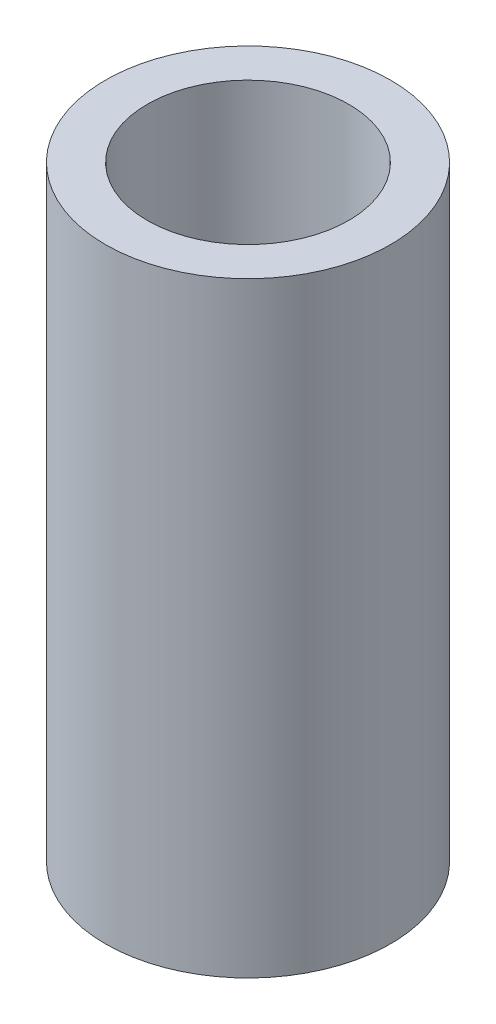
ISO-10303-21;
HEADER;
FILE_DESCRIPTION(('STEP AP214'),'2;1');
FILE_NAME('part.step','',(''),(''),'','','');
FILE_SCHEMA(('AUTOMOTIVE_DESIGN { 1 0 10303 214 1 1 1 1 }'));
ENDSEC;
DATA;
#1=APPLICATION_CONTEXT('core data for automotive mechanical design processes');
#2=APPLICATION_PROTOCOL_DEFINITION('international standard','automotive_design',2000,#1);
#3=PRODUCT_CONTEXT('',#1,'mechanical');
#4=PRODUCT('Part','Part','',(#3));
#5=PRODUCT_RELATED_PRODUCT_CATEGORY('part','',(#4));
#6=PRODUCT_DEFINITION_FORMATION('','',#4);
#7=PRODUCT_DEFINITION_CONTEXT('part definition',#1,'design');
#8=PRODUCT_DEFINITION('design','',#6,#7);
#9=PRODUCT_DEFINITION_SHAPE('','',#8);
#10=(LENGTH_UNIT() NAMED_UNIT(*) SI_UNIT(.MILLI.,.METRE.));
#11=(NAMED_UNIT(*) PLANE_ANGLE_UNIT() SI_UNIT($,.RADIAN.));
#12=(NAMED_UNIT(*) SI_UNIT($,.STERADIAN.) SOLID_ANGLE_UNIT());
#13=UNCERTAINTY_MEASURE_WITH_UNIT(LENGTH_MEASURE(1.E-05),#10,'distance_accuracy_value','');
#14=(GEOMETRIC_REPRESENTATION_CONTEXT(3) GLOBAL_UNCERTAINTY_ASSIGNED_CONTEXT((#13)) GLOBAL_UNIT_ASSIGNED_CONTEXT((#10,
#11,#12)) REPRESENTATION_CONTEXT('',''));
#15=CARTESIAN_POINT('',(0.,0.,0.));
#16=DIRECTION('',(0.,0.,1.));
#17=DIRECTION('',(1.,0.,0.));
#18=AXIS2_PLACEMENT_3D('',#15,#16,#17);
#19=CARTESIAN_POINT('',(0.,40.470836,0.));
#20=DIRECTION('',(0.,1.,0.));
#21=DIRECTION('',(0.,0.,1.));
#22=AXIS2_PLACEMENT_3D('',#19,#20,#21);
#23=PLANE('',#22);
#24=CARTESIAN_POINT('',(0.,40.470836,0.));
#25=DIRECTION('',(0.,1.,0.));
#26=DIRECTION('',(0.,0.,1.));
#27=AXIS2_PLACEMENT_3D('',#24,#25,#26);
#28=CIRCLE('',#27,9.525);
#29=CARTESIAN_POINT('',(0.,40.470836,9.525));
#30=VERTEX_POINT('',#29);
#31=EDGE_CURVE('E10',#30,#30,#28,.T.);
#32=ORIENTED_EDGE('',*,*,#31,.T.);
#33=EDGE_LOOP('',(#32));
#34=FACE_BOUND('',#33,.T.);
#35=CARTESIAN_POINT('',(0.,40.470836,0.));
#36=DIRECTION('',(0.,1.,0.));
#37=DIRECTION('',(0.,0.,1.));
#38=AXIS2_PLACEMENT_3D('',#35,#36,#37);
#39=CIRCLE('',#38,6.731);
#40=CARTESIAN_POINT('',(0.,40.470836,6.731));
#41=VERTEX_POINT('',#40);
#42=EDGE_CURVE('E41',#41,#41,#39,.T.);
#43=ORIENTED_EDGE('',*,*,#42,.F.);
#44=EDGE_LOOP('',(#43));
#45=FACE_BOUND('',#44,.T.);
#46=ADVANCED_FACE('F30',(#34,#45),#23,.T.);
#47=CARTESIAN_POINT('',(0.,0.,0.));
#48=DIRECTION('',(0.,1.,0.));
#49=DIRECTION('',(0.,0.,1.));
#50=AXIS2_PLACEMENT_3D('',#47,#48,#49);
#51=PLANE('',#50);
#52=CARTESIAN_POINT('',(0.,0.,0.));
#53=DIRECTION('',(0.,1.,0.));
#54=DIRECTION('',(0.,0.,1.));
#55=AXIS2_PLACEMENT_3D('',#52,#53,#54);
#56=CIRCLE('',#55,9.525);
#57=CARTESIAN_POINT('',(0.,0.,9.525));
#58=VERTEX_POINT('',#57);
#59=EDGE_CURVE('E34',#58,#58,#56,.T.);
#60=ORIENTED_EDGE('',*,*,#59,.F.);
#61=EDGE_LOOP('',(#60));
#62=FACE_BOUND('',#61,.T.);
#63=CARTESIAN_POINT('',(0.,0.,0.));
#64=DIRECTION('',(0.,1.,0.));
#65=DIRECTION('',(0.,0.,1.));
#66=AXIS2_PLACEMENT_3D('',#63,#64,#65);
#67=CIRCLE('',#66,6.731);
#68=CARTESIAN_POINT('',(0.,0.,6.731));
#69=VERTEX_POINT('',#68);
#70=EDGE_CURVE('E43',#69,#69,#67,.T.);
#71=ORIENTED_EDGE('',*,*,#70,.T.);
#72=EDGE_LOOP('',(#71));
#73=FACE_BOUND('',#72,.T.);
#74=ADVANCED_FACE('F53',(#62,#73),#51,.F.);
#75=CARTESIAN_POINT('',(0.,40.470836,0.));
#76=DIRECTION('',(0.,-1.,0.));
#77=DIRECTION('',(0.,0.,-1.));
#78=AXIS2_PLACEMENT_3D('',#75,#76,#77);
#79=CYLINDRICAL_SURFACE('',#78,9.525);
#80=ORIENTED_EDGE('',*,*,#31,.F.);
#81=EDGE_LOOP('',(#80));
#82=FACE_BOUND('',#81,.T.);
#83=ORIENTED_EDGE('',*,*,#59,.T.);
#84=EDGE_LOOP('',(#83));
#85=FACE_BOUND('',#84,.T.);
#86=ADVANCED_FACE('F32',(#82,#85),#79,.T.);
#87=CARTESIAN_POINT('',(0.,40.470836,0.));
#88=DIRECTION('',(0.,-1.,0.));
#89=DIRECTION('',(0.,0.,-1.));
#90=AXIS2_PLACEMENT_3D('',#87,#88,#89);
#91=CYLINDRICAL_SURFACE('',#90,6.731);
#92=ORIENTED_EDGE('',*,*,#42,.T.);
#93=EDGE_LOOP('',(#92));
#94=FACE_BOUND('',#93,.T.);
#95=ORIENTED_EDGE('',*,*,#70,.F.);
#96=EDGE_LOOP('',(#95));
#97=FACE_BOUND('',#96,.T.);
#98=ADVANCED_FACE('F49',(#94,#97),#91,.F.);
#99=CLOSED_SHELL('',(#46,#74,#86,#98));
#100=MANIFOLD_SOLID_BREP('B2',#99);
#101=ADVANCED_BREP_SHAPE_REPRESENTATION('',(#18,#100),#14);
#102=SHAPE_DEFINITION_REPRESENTATION(#9,#101);
ENDSEC;
END-ISO-10303-21;
